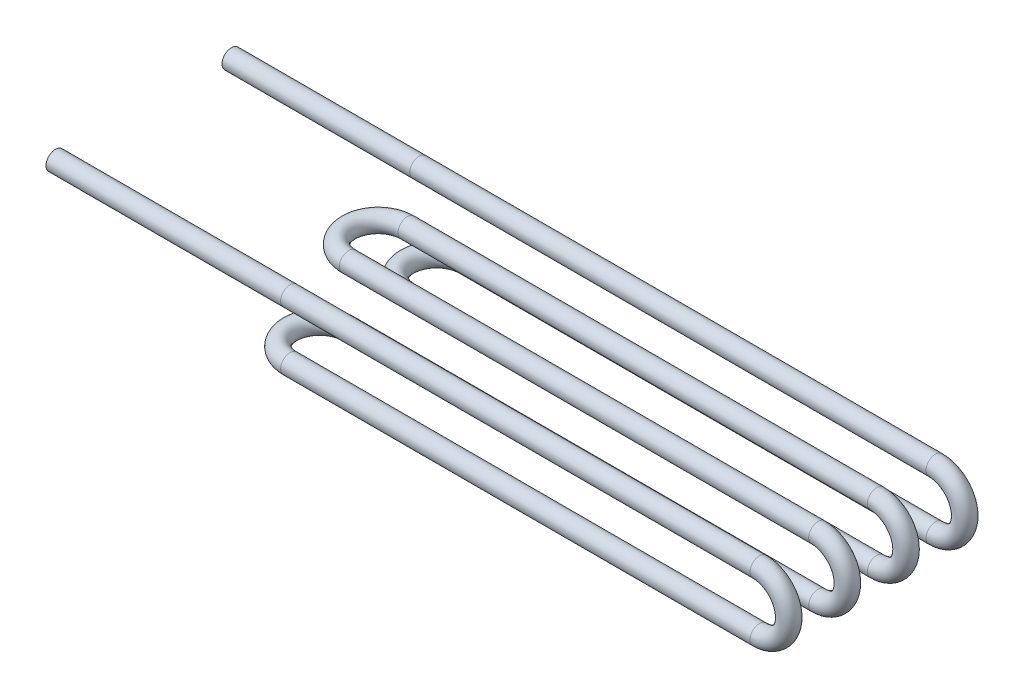
ISO-10303-21;
HEADER;
FILE_DESCRIPTION(('STEP AP214'),'2;1');
FILE_NAME('part.step','',(''),(''),'','','');
FILE_SCHEMA(('AUTOMOTIVE_DESIGN { 1 0 10303 214 1 1 1 1 }'));
ENDSEC;
DATA;
#1=APPLICATION_CONTEXT('core data for automotive mechanical design processes');
#2=APPLICATION_PROTOCOL_DEFINITION('international standard','automotive_design',2000,#1);
#3=PRODUCT_CONTEXT('',#1,'mechanical');
#4=PRODUCT('Part','Part','',(#3));
#5=PRODUCT_RELATED_PRODUCT_CATEGORY('part','',(#4));
#6=PRODUCT_DEFINITION_FORMATION('','',#4);
#7=PRODUCT_DEFINITION_CONTEXT('part definition',#1,'design');
#8=PRODUCT_DEFINITION('design','',#6,#7);
#9=PRODUCT_DEFINITION_SHAPE('','',#8);
#10=(LENGTH_UNIT() NAMED_UNIT(*) SI_UNIT(.MILLI.,.METRE.));
#11=(NAMED_UNIT(*) PLANE_ANGLE_UNIT() SI_UNIT($,.RADIAN.));
#12=(NAMED_UNIT(*) SI_UNIT($,.STERADIAN.) SOLID_ANGLE_UNIT());
#13=UNCERTAINTY_MEASURE_WITH_UNIT(LENGTH_MEASURE(1.E-05),#10,'distance_accuracy_value','');
#14=(GEOMETRIC_REPRESENTATION_CONTEXT(3) GLOBAL_UNCERTAINTY_ASSIGNED_CONTEXT((#13)) GLOBAL_UNIT_ASSIGNED_CONTEXT((#10,
#11,#12)) REPRESENTATION_CONTEXT('',''));
#15=CARTESIAN_POINT('',(0.,0.,0.));
#16=DIRECTION('',(0.,0.,1.));
#17=DIRECTION('',(1.,0.,0.));
#18=AXIS2_PLACEMENT_3D('',#15,#16,#17);
#19=CARTESIAN_POINT('',(-80.,0.,74.9992339235413));
#20=DIRECTION('',(1.,0.,0.));
#21=DIRECTION('',(0.,1.,0.));
#22=AXIS2_PLACEMENT_3D('',#19,#20,#21);
#23=CYLINDRICAL_SURFACE('',#22,4.);
#24=CARTESIAN_POINT('',(19.9999999999998,0.,74.9992339235413));
#25=DIRECTION('',(-1.,0.,0.));
#26=DIRECTION('',(0.,2.63801784115706E-05,0.999999999652043));
#27=AXIS2_PLACEMENT_3D('',#24,#25,#26);
#28=CIRCLE('',#27,4.);
#29=CARTESIAN_POINT('',(19.9999999999998,0.00010552071372467,78.9992339221495));
#30=VERTEX_POINT('',#29);
#31=EDGE_CURVE('E56',#30,#30,#28,.T.);
#32=ORIENTED_EDGE('',*,*,#31,.T.);
#33=EDGE_LOOP('',(#32));
#34=FACE_BOUND('',#33,.T.);
#35=CARTESIAN_POINT('',(-80.,0.,74.9992339235413));
#36=DIRECTION('',(-1.,0.,0.));
#37=DIRECTION('',(0.,2.63801784115706E-05,0.999999999652043));
#38=AXIS2_PLACEMENT_3D('',#35,#36,#37);
#39=CIRCLE('',#38,4.);
#40=CARTESIAN_POINT('',(-80.,0.000105520713672086,78.9992339221495));
#41=VERTEX_POINT('',#40);
#42=EDGE_CURVE('E53',#41,#41,#39,.T.);
#43=ORIENTED_EDGE('',*,*,#42,.F.);
#44=EDGE_LOOP('',(#43));
#45=FACE_BOUND('',#44,.T.);
#46=ADVANCED_FACE('F32',(#34,#45),#23,.T.);
#47=CARTESIAN_POINT('',(19.9999999999998,0.,74.9992339235413));
#48=DIRECTION('',(1.,0.,0.));
#49=DIRECTION('',(0.,0.,-1.));
#50=AXIS2_PLACEMENT_3D('',#47,#48,#49);
#51=CYLINDRICAL_SURFACE('',#50,4.);
#52=CARTESIAN_POINT('',(220.,0.,74.9992339235413));
#53=DIRECTION('',(-1.,0.,0.));
#54=DIRECTION('',(0.,2.63801784115706E-05,0.999999999652043));
#55=AXIS2_PLACEMENT_3D('',#52,#53,#54);
#56=CIRCLE('',#55,4.);
#57=CARTESIAN_POINT('',(220.,4.00000000000009,74.9992339235413));
#58=VERTEX_POINT('',#57);
#59=EDGE_CURVE('E59',#58,#58,#56,.T.);
#60=ORIENTED_EDGE('',*,*,#59,.T.);
#61=EDGE_LOOP('',(#60));
#62=FACE_BOUND('',#61,.T.);
#63=ORIENTED_EDGE('',*,*,#31,.F.);
#64=EDGE_LOOP('',(#63));
#65=FACE_BOUND('',#64,.T.);
#66=ADVANCED_FACE('F137',(#62,#65),#51,.T.);
#67=CARTESIAN_POINT('',(220.,-12.4999999999999,74.9992339235413));
#68=DIRECTION('',(0.,0.,-1.));
#69=DIRECTION('',(-1.,0.,0.));
#70=AXIS2_PLACEMENT_3D('',#67,#68,#69);
#71=TOROIDAL_SURFACE('',#70,12.5,4.);
#72=CARTESIAN_POINT('',(220.,-24.9999999999999,74.9992339235413));
#73=DIRECTION('',(1.,0.,0.));
#74=DIRECTION('',(0.,-2.63801784115706E-05,0.999999999652043));
#75=AXIS2_PLACEMENT_3D('',#72,#73,#74);
#76=CIRCLE('',#75,4.);
#77=CARTESIAN_POINT('',(220.,-28.9999999999999,74.9992339235413));
#78=VERTEX_POINT('',#77);
#79=EDGE_CURVE('E62',#78,#78,#76,.T.);
#80=CARTESIAN_POINT('',(220.,-12.4999999999999,74.9992339235413));
#81=DIRECTION('',(0.,0.,-1.));
#82=DIRECTION('',(-1.,0.,0.));
#83=AXIS2_PLACEMENT_3D('',#80,#81,#82);
#84=CIRCLE('',#83,16.5);
#85=EDGE_CURVE('',#58,#78,#84,.T.);
#86=ORIENTED_EDGE('',*,*,#59,.F.);
#87=ORIENTED_EDGE('',*,*,#79,.T.);
#88=ORIENTED_EDGE('',*,*,#85,.T.);
#89=ORIENTED_EDGE('',*,*,#85,.F.);
#90=EDGE_LOOP('',(#86,#88,#87,#89));
#91=FACE_BOUND('',#90,.T.);
#92=ADVANCED_FACE('F141',(#91),#71,.T.);
#93=CARTESIAN_POINT('',(220.,-24.9999999999999,74.9992339235413));
#94=DIRECTION('',(-1.,0.,0.));
#95=DIRECTION('',(0.,0.,1.));
#96=AXIS2_PLACEMENT_3D('',#93,#94,#95);
#97=CYLINDRICAL_SURFACE('',#96,4.);
#98=CARTESIAN_POINT('',(19.9999999999998,-24.9999999999999,74.9992339235413));
#99=DIRECTION('',(1.,0.,0.));
#100=DIRECTION('',(0.,-2.63801784115706E-05,0.999999999652043));
#101=AXIS2_PLACEMENT_3D('',#98,#99,#100);
#102=CIRCLE('',#101,4.);
#103=CARTESIAN_POINT('',(19.9999999999998,-25.0264824714281,78.999146257419));
#104=VERTEX_POINT('',#103);
#105=EDGE_CURVE('E65',#104,#104,#102,.T.);
#106=ORIENTED_EDGE('',*,*,#105,.T.);
#107=EDGE_LOOP('',(#106));
#108=FACE_BOUND('',#107,.T.);
#109=ORIENTED_EDGE('',*,*,#79,.F.);
#110=EDGE_LOOP('',(#109));
#111=FACE_BOUND('',#110,.T.);
#112=ADVANCED_FACE('F145',(#108,#111),#97,.T.);
#113=CARTESIAN_POINT('',(19.9999999999998,-24.9172422767867,62.4995078801734));
#114=DIRECTION('',(0.,-0.999978083469428,-0.00662061785705991));
#115=DIRECTION('',(0.,0.00662061785705991,-0.999978083469428));
#116=AXIS2_PLACEMENT_3D('',#113,#114,#115);
#117=TOROIDAL_SURFACE('',#116,12.5,4.);
#118=CARTESIAN_POINT('',(19.9999999999998,-24.8344845535734,49.9997818368056));
#119=DIRECTION('',(-1.,0.,0.));
#120=DIRECTION('',(0.,0.0132145676417762,-0.99991268378896));
#121=AXIS2_PLACEMENT_3D('',#118,#119,#120);
#122=CIRCLE('',#121,4.);
#123=CARTESIAN_POINT('',(19.9999999999998,-24.8080020821452,45.9998695029279));
#124=VERTEX_POINT('',#123);
#125=EDGE_CURVE('E68',#124,#124,#122,.T.);
#126=CARTESIAN_POINT('',(19.9999999999998,-24.9172422767867,62.4995078801734));
#127=DIRECTION('',(0.,-0.999978083469428,-0.00662061785705991));
#128=DIRECTION('',(0.,0.00662061785705991,-0.999978083469428));
#129=AXIS2_PLACEMENT_3D('',#126,#127,#128);
#130=CIRCLE('',#129,16.5);
#131=EDGE_CURVE('',#104,#124,#130,.T.);
#132=ORIENTED_EDGE('',*,*,#105,.F.);
#133=ORIENTED_EDGE('',*,*,#125,.T.);
#134=ORIENTED_EDGE('',*,*,#131,.T.);
#135=ORIENTED_EDGE('',*,*,#131,.F.);
#136=EDGE_LOOP('',(#132,#134,#133,#135));
#137=FACE_BOUND('',#136,.T.);
#138=ADVANCED_FACE('F149',(#137),#117,.T.);
#139=CARTESIAN_POINT('',(19.9999999999998,-24.8344845535734,49.9997818368056));
#140=DIRECTION('',(1.,0.,0.));
#141=DIRECTION('',(0.,1.,0.));
#142=AXIS2_PLACEMENT_3D('',#139,#140,#141);
#143=CYLINDRICAL_SURFACE('',#142,4.);
#144=CARTESIAN_POINT('',(220.,-24.8344845535735,49.9997818368056));
#145=DIRECTION('',(-1.,0.,0.));
#146=DIRECTION('',(0.,0.0132145676417762,-0.99991268378896));
#147=AXIS2_PLACEMENT_3D('',#144,#145,#146);
#148=CIRCLE('',#147,4.);
#149=CARTESIAN_POINT('',(220.,-28.8344845532255,49.9998345968145));
#150=VERTEX_POINT('',#149);
#151=EDGE_CURVE('E71',#150,#150,#148,.T.);
#152=ORIENTED_EDGE('',*,*,#151,.T.);
#153=EDGE_LOOP('',(#152));
#154=FACE_BOUND('',#153,.T.);
#155=ORIENTED_EDGE('',*,*,#125,.F.);
#156=EDGE_LOOP('',(#155));
#157=FACE_BOUND('',#156,.T.);
#158=ADVANCED_FACE('F153',(#154,#157),#143,.T.);
#159=CARTESIAN_POINT('',(220.,-12.3344845546608,49.9996169617778));
#160=DIRECTION('',(0.,1.31900022190545E-05,0.999999999913012));
#161=DIRECTION('',(0.,-0.999999999913012,1.31900022190545E-05));
#162=AXIS2_PLACEMENT_3D('',#159,#160,#161);
#163=TOROIDAL_SURFACE('',#162,12.5,4.);
#164=CARTESIAN_POINT('',(220.,0.165515444251831,49.9994520867501));
#165=DIRECTION('',(1.,0.,0.));
#166=DIRECTION('',(0.,-0.013240945338212,-0.999912334840685));
#167=AXIS2_PLACEMENT_3D('',#164,#165,#166);
#168=CIRCLE('',#167,4.);
#169=CARTESIAN_POINT('',(220.,4.16551544390388,49.9993993267412));
#170=VERTEX_POINT('',#169);
#171=EDGE_CURVE('E74',#170,#170,#168,.T.);
#172=CARTESIAN_POINT('',(220.,-12.3344845546608,49.9996169617778));
#173=DIRECTION('',(0.,1.31900022190545E-05,0.999999999913012));
#174=DIRECTION('',(0.,-0.999999999913012,1.31900022190545E-05));
#175=AXIS2_PLACEMENT_3D('',#172,#173,#174);
#176=CIRCLE('',#175,16.5);
#177=EDGE_CURVE('',#150,#170,#176,.T.);
#178=ORIENTED_EDGE('',*,*,#151,.F.);
#179=ORIENTED_EDGE('',*,*,#171,.T.);
#180=ORIENTED_EDGE('',*,*,#177,.T.);
#181=ORIENTED_EDGE('',*,*,#177,.F.);
#182=EDGE_LOOP('',(#178,#180,#179,#181));
#183=FACE_BOUND('',#182,.T.);
#184=ADVANCED_FACE('F157',(#183),#163,.T.);
#185=CARTESIAN_POINT('',(220.,0.16551544425183,49.9994520867501));
#186=DIRECTION('',(-1.,0.,0.));
#187=DIRECTION('',(0.,-1.,0.));
#188=AXIS2_PLACEMENT_3D('',#185,#186,#187);
#189=CYLINDRICAL_SURFACE('',#188,4.);
#190=CARTESIAN_POINT('',(20.,0.165515444251878,49.9994520867501));
#191=DIRECTION('',(1.,0.,0.));
#192=DIRECTION('',(0.,-0.013240945338212,-0.999912334840685));
#193=AXIS2_PLACEMENT_3D('',#190,#191,#192);
#194=CIRCLE('',#193,4.);
#195=CARTESIAN_POINT('',(20.,0.165515444251878,53.9994520867501));
#196=VERTEX_POINT('',#195);
#197=EDGE_CURVE('E77',#196,#196,#194,.T.);
#198=ORIENTED_EDGE('',*,*,#197,.T.);
#199=EDGE_LOOP('',(#198));
#200=FACE_BOUND('',#199,.T.);
#201=ORIENTED_EDGE('',*,*,#171,.F.);
#202=EDGE_LOOP('',(#201));
#203=FACE_BOUND('',#202,.T.);
#204=ADVANCED_FACE('F161',(#200,#203),#189,.T.);
#205=CARTESIAN_POINT('',(20.,0.165515444251878,37.4994520867501));
#206=DIRECTION('',(0.,-1.,0.));
#207=DIRECTION('',(0.,0.,-1.));
#208=AXIS2_PLACEMENT_3D('',#205,#206,#207);
#209=TOROIDAL_SURFACE('',#208,12.5,4.);
#210=CARTESIAN_POINT('',(20.,0.165515444251878,24.9994520867501));
#211=DIRECTION('',(-1.,0.,0.));
#212=DIRECTION('',(0.,-0.013240945338212,0.999912334840685));
#213=AXIS2_PLACEMENT_3D('',#210,#211,#212);
#214=CIRCLE('',#213,4.);
#215=CARTESIAN_POINT('',(20.,0.165515444251878,20.9994520867501));
#216=VERTEX_POINT('',#215);
#217=EDGE_CURVE('E80',#216,#216,#214,.T.);
#218=CARTESIAN_POINT('',(20.,0.165515444251878,37.4994520867501));
#219=DIRECTION('',(0.,-1.,0.));
#220=DIRECTION('',(0.,0.,-1.));
#221=AXIS2_PLACEMENT_3D('',#218,#219,#220);
#222=CIRCLE('',#221,16.5);
#223=EDGE_CURVE('',#196,#216,#222,.T.);
#224=ORIENTED_EDGE('',*,*,#197,.F.);
#225=ORIENTED_EDGE('',*,*,#217,.T.);
#226=ORIENTED_EDGE('',*,*,#223,.T.);
#227=ORIENTED_EDGE('',*,*,#223,.F.);
#228=EDGE_LOOP('',(#224,#226,#225,#227));
#229=FACE_BOUND('',#228,.T.);
#230=ADVANCED_FACE('F165',(#229),#209,.T.);
#231=CARTESIAN_POINT('',(20.,0.16551544425186,24.9994520867501));
#232=DIRECTION('',(1.,0.,0.));
#233=DIRECTION('',(0.,1.,0.));
#234=AXIS2_PLACEMENT_3D('',#231,#232,#233);
#235=CYLINDRICAL_SURFACE('',#234,4.);
#236=CARTESIAN_POINT('',(220.,0.165515444251848,24.9994520867501));
#237=DIRECTION('',(-1.,0.,0.));
#238=DIRECTION('',(0.,-0.013240945338212,0.999912334840685));
#239=AXIS2_PLACEMENT_3D('',#236,#237,#238);
#240=CIRCLE('',#239,4.);
#241=CARTESIAN_POINT('',(220.,4.16551544425185,24.9994520867501));
#242=VERTEX_POINT('',#241);
#243=EDGE_CURVE('E83',#242,#242,#240,.T.);
#244=ORIENTED_EDGE('',*,*,#243,.T.);
#245=EDGE_LOOP('',(#244));
#246=FACE_BOUND('',#245,.T.);
#247=ORIENTED_EDGE('',*,*,#217,.F.);
#248=EDGE_LOOP('',(#247));
#249=FACE_BOUND('',#248,.T.);
#250=ADVANCED_FACE('F169',(#246,#249),#235,.T.);
#251=CARTESIAN_POINT('',(220.,-12.3344845557481,24.9994520867501));
#252=DIRECTION('',(0.,0.,-1.));
#253=DIRECTION('',(-1.,0.,0.));
#254=AXIS2_PLACEMENT_3D('',#251,#252,#253);
#255=TOROIDAL_SURFACE('',#254,12.5,4.);
#256=CARTESIAN_POINT('',(220.,-24.8344845557481,24.9994520867501));
#257=DIRECTION('',(1.,0.,0.));
#258=DIRECTION('',(0.,0.013240945338212,0.999912334840685));
#259=AXIS2_PLACEMENT_3D('',#256,#257,#258);
#260=CIRCLE('',#259,4.);
#261=CARTESIAN_POINT('',(220.,-28.8344845557481,24.9994520867501));
#262=VERTEX_POINT('',#261);
#263=EDGE_CURVE('E86',#262,#262,#260,.T.);
#264=CARTESIAN_POINT('',(220.,-12.3344845557481,24.9994520867501));
#265=DIRECTION('',(0.,0.,-1.));
#266=DIRECTION('',(-1.,0.,0.));
#267=AXIS2_PLACEMENT_3D('',#264,#265,#266);
#268=CIRCLE('',#267,16.5);
#269=EDGE_CURVE('',#242,#262,#268,.T.);
#270=ORIENTED_EDGE('',*,*,#243,.F.);
#271=ORIENTED_EDGE('',*,*,#263,.T.);
#272=ORIENTED_EDGE('',*,*,#269,.T.);
#273=ORIENTED_EDGE('',*,*,#269,.F.);
#274=EDGE_LOOP('',(#270,#272,#271,#273));
#275=FACE_BOUND('',#274,.T.);
#276=ADVANCED_FACE('F173',(#275),#255,.T.);
#277=CARTESIAN_POINT('',(220.,-24.8344845557481,24.9994520867501));
#278=DIRECTION('',(-1.,0.,0.));
#279=DIRECTION('',(0.,0.,1.));
#280=AXIS2_PLACEMENT_3D('',#277,#278,#279);
#281=CYLINDRICAL_SURFACE('',#280,4.);
#282=CARTESIAN_POINT('',(20.,-24.8344845557481,24.9994520867501));
#283=DIRECTION('',(1.,0.,0.));
#284=DIRECTION('',(0.,0.013240945338212,0.999912334840685));
#285=AXIS2_PLACEMENT_3D('',#282,#283,#284);
#286=CIRCLE('',#285,4.);
#287=CARTESIAN_POINT('',(20.,-24.8080020846678,28.9993644206301));
#288=VERTEX_POINT('',#287);
#289=EDGE_CURVE('E89',#288,#288,#286,.T.);
#290=ORIENTED_EDGE('',*,*,#289,.T.);
#291=EDGE_LOOP('',(#290));
#292=FACE_BOUND('',#291,.T.);
#293=ORIENTED_EDGE('',*,*,#263,.F.);
#294=EDGE_LOOP('',(#293));
#295=FACE_BOUND('',#294,.T.);
#296=ADVANCED_FACE('F177',(#292,#295),#281,.T.);
#297=CARTESIAN_POINT('',(20.,-24.9172422778741,12.499726043375));
#298=DIRECTION('',(0.,-0.999978083470004,0.00662061777007394));
#299=DIRECTION('',(0.,-0.00662061777007394,-0.999978083470004));
#300=AXIS2_PLACEMENT_3D('',#297,#298,#299);
#301=TOROIDAL_SURFACE('',#300,12.5,4.);
#302=CARTESIAN_POINT('',(20.,-25.,0.));
#303=DIRECTION('',(-1.,0.,0.));
#304=DIRECTION('',(0.,0.,-1.));
#305=AXIS2_PLACEMENT_3D('',#302,#303,#304);
#306=CIRCLE('',#305,4.);
#307=CARTESIAN_POINT('',(20.,-25.0264824710803,-3.99991233388003));
#308=VERTEX_POINT('',#307);
#309=EDGE_CURVE('E92',#308,#308,#306,.T.);
#310=CARTESIAN_POINT('',(20.,-24.9172422778741,12.499726043375));
#311=DIRECTION('',(0.,-0.999978083470004,0.00662061777007394));
#312=DIRECTION('',(0.,-0.00662061777007394,-0.999978083470004));
#313=AXIS2_PLACEMENT_3D('',#310,#311,#312);
#314=CIRCLE('',#313,16.5);
#315=EDGE_CURVE('',#288,#308,#314,.T.);
#316=ORIENTED_EDGE('',*,*,#289,.F.);
#317=ORIENTED_EDGE('',*,*,#309,.T.);
#318=ORIENTED_EDGE('',*,*,#315,.T.);
#319=ORIENTED_EDGE('',*,*,#315,.F.);
#320=EDGE_LOOP('',(#316,#318,#317,#319));
#321=FACE_BOUND('',#320,.T.);
#322=ADVANCED_FACE('F181',(#321),#301,.T.);
#323=CARTESIAN_POINT('',(20.,-25.,0.));
#324=DIRECTION('',(1.,0.,0.));
#325=DIRECTION('',(0.,0.,-1.));
#326=AXIS2_PLACEMENT_3D('',#323,#324,#325);
#327=CYLINDRICAL_SURFACE('',#326,4.);
#328=CARTESIAN_POINT('',(220.,-25.,0.));
#329=DIRECTION('',(-1.,0.,0.));
#330=DIRECTION('',(0.,0.,-1.));
#331=AXIS2_PLACEMENT_3D('',#328,#329,#330);
#332=CIRCLE('',#331,4.);
#333=CARTESIAN_POINT('',(220.,-29.,0.));
#334=VERTEX_POINT('',#333);
#335=EDGE_CURVE('E95',#334,#334,#332,.T.);
#336=ORIENTED_EDGE('',*,*,#335,.T.);
#337=EDGE_LOOP('',(#336));
#338=FACE_BOUND('',#337,.T.);
#339=ORIENTED_EDGE('',*,*,#309,.F.);
#340=EDGE_LOOP('',(#339));
#341=FACE_BOUND('',#340,.T.);
#342=ADVANCED_FACE('F185',(#338,#341),#327,.T.);
#343=CARTESIAN_POINT('',(220.,-12.5,0.));
#344=DIRECTION('',(0.,0.,1.));
#345=DIRECTION('',(1.,0.,0.));
#346=AXIS2_PLACEMENT_3D('',#343,#344,#345);
#347=TOROIDAL_SURFACE('',#346,12.5,4.);
#348=CARTESIAN_POINT('',(220.,0.,0.));
#349=DIRECTION('',(1.,0.,0.));
#350=DIRECTION('',(0.,0.,-1.));
#351=AXIS2_PLACEMENT_3D('',#348,#349,#350);
#352=CIRCLE('',#351,4.);
#353=CARTESIAN_POINT('',(220.,4.,0.));
#354=VERTEX_POINT('',#353);
#355=EDGE_CURVE('E97',#354,#354,#352,.T.);
#356=CARTESIAN_POINT('',(220.,-12.5,0.));
#357=DIRECTION('',(0.,0.,1.));
#358=DIRECTION('',(1.,0.,0.));
#359=AXIS2_PLACEMENT_3D('',#356,#357,#358);
#360=CIRCLE('',#359,16.5);
#361=EDGE_CURVE('',#334,#354,#360,.T.);
#362=ORIENTED_EDGE('',*,*,#335,.F.);
#363=ORIENTED_EDGE('',*,*,#355,.T.);
#364=ORIENTED_EDGE('',*,*,#361,.T.);
#365=ORIENTED_EDGE('',*,*,#361,.F.);
#366=EDGE_LOOP('',(#362,#364,#363,#365));
#367=FACE_BOUND('',#366,.T.);
#368=ADVANCED_FACE('F117',(#367),#347,.T.);
#369=CARTESIAN_POINT('',(220.,0.,0.));
#370=DIRECTION('',(-1.,0.,0.));
#371=DIRECTION('',(0.,0.,1.));
#372=AXIS2_PLACEMENT_3D('',#369,#370,#371);
#373=CYLINDRICAL_SURFACE('',#372,4.);
#374=CARTESIAN_POINT('',(0.,0.,0.));
#375=DIRECTION('',(1.,0.,0.));
#376=DIRECTION('',(0.,0.,-1.));
#377=AXIS2_PLACEMENT_3D('',#374,#375,#376);
#378=CIRCLE('',#377,4.);
#379=CARTESIAN_POINT('',(0.,0.,-4.));
#380=VERTEX_POINT('',#379);
#381=EDGE_CURVE('E36',#380,#380,#378,.T.);
#382=ORIENTED_EDGE('',*,*,#381,.T.);
#383=EDGE_LOOP('',(#382));
#384=FACE_BOUND('',#383,.T.);
#385=ORIENTED_EDGE('',*,*,#355,.F.);
#386=EDGE_LOOP('',(#385));
#387=FACE_BOUND('',#386,.T.);
#388=ADVANCED_FACE('F104',(#384,#387),#373,.T.);
#389=CARTESIAN_POINT('',(0.,0.,0.));
#390=DIRECTION('',(-1.,0.,0.));
#391=DIRECTION('',(0.,0.,1.));
#392=AXIS2_PLACEMENT_3D('',#389,#390,#391);
#393=CYLINDRICAL_SURFACE('',#392,4.);
#394=CARTESIAN_POINT('',(-80.,0.,0.));
#395=DIRECTION('',(1.,0.,0.));
#396=DIRECTION('',(0.,0.,-1.));
#397=AXIS2_PLACEMENT_3D('',#394,#395,#396);
#398=CIRCLE('',#397,4.);
#399=CARTESIAN_POINT('',(-80.,0.,-4.));
#400=VERTEX_POINT('',#399);
#401=EDGE_CURVE('E49',#400,#400,#398,.T.);
#402=ORIENTED_EDGE('',*,*,#401,.T.);
#403=EDGE_LOOP('',(#402));
#404=FACE_BOUND('',#403,.T.);
#405=ORIENTED_EDGE('',*,*,#381,.F.);
#406=EDGE_LOOP('',(#405));
#407=FACE_BOUND('',#406,.T.);
#408=ADVANCED_FACE('F34',(#404,#407),#393,.T.);
#409=CARTESIAN_POINT('',(-80.,0.,74.9992339235413));
#410=DIRECTION('',(-1.,0.,0.));
#411=DIRECTION('',(0.,2.63801784115706E-05,0.999999999652043));
#412=AXIS2_PLACEMENT_3D('',#409,#410,#411);
#413=PLANE('',#412);
#414=CARTESIAN_POINT('',(-80.,0.,74.9992339235413));
#415=DIRECTION('',(-1.,0.,0.));
#416=DIRECTION('',(0.,2.63801784115706E-05,0.999999999652043));
#417=AXIS2_PLACEMENT_3D('',#414,#415,#416);
#418=CIRCLE('',#417,3.);
#419=CARTESIAN_POINT('',(-80.,7.91405352605157E-05,77.9992339224975));
#420=VERTEX_POINT('',#419);
#421=EDGE_CURVE('E52',#420,#420,#418,.F.);
#422=ORIENTED_EDGE('',*,*,#421,.T.);
#423=EDGE_LOOP('',(#422));
#424=FACE_BOUND('',#423,.T.);
#425=ORIENTED_EDGE('',*,*,#42,.T.);
#426=EDGE_LOOP('',(#425));
#427=FACE_BOUND('',#426,.T.);
#428=ADVANCED_FACE('F108',(#424,#427),#413,.T.);
#429=CARTESIAN_POINT('',(-80.,0.,0.));
#430=DIRECTION('',(1.,0.,0.));
#431=DIRECTION('',(0.,0.,-1.));
#432=AXIS2_PLACEMENT_3D('',#429,#430,#431);
#433=PLANE('',#432);
#434=CARTESIAN_POINT('',(-80.,0.,0.));
#435=DIRECTION('',(1.,0.,0.));
#436=DIRECTION('',(0.,0.,-1.));
#437=AXIS2_PLACEMENT_3D('',#434,#435,#436);
#438=CIRCLE('',#437,3.);
#439=CARTESIAN_POINT('',(-80.,0.,-3.));
#440=VERTEX_POINT('',#439);
#441=EDGE_CURVE('E10',#440,#440,#438,.F.);
#442=ORIENTED_EDGE('',*,*,#441,.F.);
#443=EDGE_LOOP('',(#442));
#444=FACE_BOUND('',#443,.T.);
#445=ORIENTED_EDGE('',*,*,#401,.F.);
#446=EDGE_LOOP('',(#445));
#447=FACE_BOUND('',#446,.T.);
#448=ADVANCED_FACE('F114',(#444,#447),#433,.F.);
#449=CARTESIAN_POINT('',(-80.,0.,74.9992339235413));
#450=DIRECTION('',(1.,0.,0.));
#451=DIRECTION('',(0.,1.,0.));
#452=AXIS2_PLACEMENT_3D('',#449,#450,#451);
#453=CYLINDRICAL_SURFACE('',#452,3.);
#454=CARTESIAN_POINT('',(19.9999999999998,0.,74.9992339235413));
#455=DIRECTION('',(-1.,0.,0.));
#456=DIRECTION('',(0.,2.63801784115706E-05,0.999999999652043));
#457=AXIS2_PLACEMENT_3D('',#454,#455,#456);
#458=CIRCLE('',#457,3.);
#459=CARTESIAN_POINT('',(19.9999999999998,7.91405353130995E-05,77.9992339224974));
#460=VERTEX_POINT('',#459);
#461=EDGE_CURVE('E451',#460,#460,#458,.F.);
#462=ORIENTED_EDGE('',*,*,#461,.T.);
#463=EDGE_LOOP('',(#462));
#464=FACE_BOUND('',#463,.T.);
#465=ORIENTED_EDGE('',*,*,#421,.F.);
#466=EDGE_LOOP('',(#465));
#467=FACE_BOUND('',#466,.T.);
#468=ADVANCED_FACE('F132',(#464,#467),#453,.F.);
#469=CARTESIAN_POINT('',(19.9999999999998,0.,74.9992339235413));
#470=DIRECTION('',(1.,0.,0.));
#471=DIRECTION('',(0.,0.,-1.));
#472=AXIS2_PLACEMENT_3D('',#469,#470,#471);
#473=CYLINDRICAL_SURFACE('',#472,3.);
#474=CARTESIAN_POINT('',(220.,0.,74.9992339235413));
#475=DIRECTION('',(-1.,0.,0.));
#476=DIRECTION('',(0.,2.63801784115706E-05,0.999999999652043));
#477=AXIS2_PLACEMENT_3D('',#474,#475,#476);
#478=CIRCLE('',#477,3.);
#479=CARTESIAN_POINT('',(220.,3.00000000000009,74.9992339235413));
#480=VERTEX_POINT('',#479);
#481=EDGE_CURVE('E448',#480,#480,#478,.F.);
#482=ORIENTED_EDGE('',*,*,#481,.T.);
#483=EDGE_LOOP('',(#482));
#484=FACE_BOUND('',#483,.T.);
#485=ORIENTED_EDGE('',*,*,#461,.F.);
#486=EDGE_LOOP('',(#485));
#487=FACE_BOUND('',#486,.T.);
#488=ADVANCED_FACE('F255',(#484,#487),#473,.F.);
#489=CARTESIAN_POINT('',(220.,-12.4999999999999,74.9992339235413));
#490=DIRECTION('',(0.,0.,-1.));
#491=DIRECTION('',(-1.,0.,0.));
#492=AXIS2_PLACEMENT_3D('',#489,#490,#491);
#493=TOROIDAL_SURFACE('',#492,12.5,3.);
#494=CARTESIAN_POINT('',(220.,-24.9999999999999,74.9992339235413));
#495=DIRECTION('',(1.,0.,0.));
#496=DIRECTION('',(0.,-2.63801784115706E-05,0.999999999652043));
#497=AXIS2_PLACEMENT_3D('',#494,#495,#496);
#498=CIRCLE('',#497,3.);
#499=CARTESIAN_POINT('',(220.,-27.9999999999999,74.9992339235413));
#500=VERTEX_POINT('',#499);
#501=EDGE_CURVE('E445',#500,#500,#498,.F.);
#502=CARTESIAN_POINT('',(220.,-12.4999999999999,74.9992339235413));
#503=DIRECTION('',(0.,0.,-1.));
#504=DIRECTION('',(-1.,0.,0.));
#505=AXIS2_PLACEMENT_3D('',#502,#503,#504);
#506=CIRCLE('',#505,15.5);
#507=EDGE_CURVE('',#480,#500,#506,.T.);
#508=ORIENTED_EDGE('',*,*,#481,.F.);
#509=ORIENTED_EDGE('',*,*,#501,.T.);
#510=ORIENTED_EDGE('',*,*,#507,.T.);
#511=ORIENTED_EDGE('',*,*,#507,.F.);
#512=EDGE_LOOP('',(#508,#510,#509,#511));
#513=FACE_BOUND('',#512,.T.);
#514=ADVANCED_FACE('F265',(#513),#493,.F.);
#515=CARTESIAN_POINT('',(220.,-24.9999999999999,74.9992339235413));
#516=DIRECTION('',(-1.,0.,0.));
#517=DIRECTION('',(0.,0.,1.));
#518=AXIS2_PLACEMENT_3D('',#515,#516,#517);
#519=CYLINDRICAL_SURFACE('',#518,3.);
#520=CARTESIAN_POINT('',(19.9999999999998,-24.9999999999999,74.9992339235413));
#521=DIRECTION('',(1.,0.,0.));
#522=DIRECTION('',(0.,-2.63801784115706E-05,0.999999999652043));
#523=AXIS2_PLACEMENT_3D('',#520,#521,#522);
#524=CIRCLE('',#523,3.);
#525=CARTESIAN_POINT('',(19.9999999999998,-25.0198618535711,77.9991681739496));
#526=VERTEX_POINT('',#525);
#527=EDGE_CURVE('E442',#526,#526,#524,.F.);
#528=ORIENTED_EDGE('',*,*,#527,.T.);
#529=EDGE_LOOP('',(#528));
#530=FACE_BOUND('',#529,.T.);
#531=ORIENTED_EDGE('',*,*,#501,.F.);
#532=EDGE_LOOP('',(#531));
#533=FACE_BOUND('',#532,.T.);
#534=ADVANCED_FACE('F275',(#530,#533),#519,.F.);
#535=CARTESIAN_POINT('',(19.9999999999998,-24.9172422767867,62.4995078801734));
#536=DIRECTION('',(0.,-0.999978083469428,-0.00662061785705991));
#537=DIRECTION('',(0.,0.00662061785705991,-0.999978083469428));
#538=AXIS2_PLACEMENT_3D('',#535,#536,#537);
#539=TOROIDAL_SURFACE('',#538,12.5,3.);
#540=CARTESIAN_POINT('',(19.9999999999998,-24.8344845535734,49.9997818368056));
#541=DIRECTION('',(-1.,0.,0.));
#542=DIRECTION('',(0.,0.0132145676417762,-0.99991268378896));
#543=AXIS2_PLACEMENT_3D('',#540,#541,#542);
#544=CIRCLE('',#543,3.);
#545=CARTESIAN_POINT('',(19.9999999999998,-24.8146227000022,46.9998475863973));
#546=VERTEX_POINT('',#545);
#547=EDGE_CURVE('E439',#546,#546,#544,.F.);
#548=CARTESIAN_POINT('',(19.9999999999998,-24.9172422767867,62.4995078801734));
#549=DIRECTION('',(0.,-0.999978083469428,-0.00662061785705991));
#550=DIRECTION('',(0.,0.00662061785705991,-0.999978083469428));
#551=AXIS2_PLACEMENT_3D('',#548,#549,#550);
#552=CIRCLE('',#551,15.5);
#553=EDGE_CURVE('',#526,#546,#552,.T.);
#554=ORIENTED_EDGE('',*,*,#527,.F.);
#555=ORIENTED_EDGE('',*,*,#547,.T.);
#556=ORIENTED_EDGE('',*,*,#553,.T.);
#557=ORIENTED_EDGE('',*,*,#553,.F.);
#558=EDGE_LOOP('',(#554,#556,#555,#557));
#559=FACE_BOUND('',#558,.T.);
#560=ADVANCED_FACE('F285',(#559),#539,.F.);
#561=CARTESIAN_POINT('',(19.9999999999998,-24.8344845535734,49.9997818368056));
#562=DIRECTION('',(1.,0.,0.));
#563=DIRECTION('',(0.,1.,0.));
#564=AXIS2_PLACEMENT_3D('',#561,#562,#563);
#565=CYLINDRICAL_SURFACE('',#564,3.);
#566=CARTESIAN_POINT('',(220.,-24.8344845535735,49.9997818368056));
#567=DIRECTION('',(-1.,0.,0.));
#568=DIRECTION('',(0.,0.0132145676417762,-0.99991268378896));
#569=AXIS2_PLACEMENT_3D('',#566,#567,#568);
#570=CIRCLE('',#569,3.);
#571=CARTESIAN_POINT('',(220.,-27.8344845533125,49.9998214068122));
#572=VERTEX_POINT('',#571);
#573=EDGE_CURVE('E436',#572,#572,#570,.F.);
#574=ORIENTED_EDGE('',*,*,#573,.T.);
#575=EDGE_LOOP('',(#574));
#576=FACE_BOUND('',#575,.T.);
#577=ORIENTED_EDGE('',*,*,#547,.F.);
#578=EDGE_LOOP('',(#577));
#579=FACE_BOUND('',#578,.T.);
#580=ADVANCED_FACE('F295',(#576,#579),#565,.F.);
#581=CARTESIAN_POINT('',(220.,-12.3344845546608,49.9996169617778));
#582=DIRECTION('',(0.,1.31900022190545E-05,0.999999999913012));
#583=DIRECTION('',(0.,-0.999999999913012,1.31900022190545E-05));
#584=AXIS2_PLACEMENT_3D('',#581,#582,#583);
#585=TOROIDAL_SURFACE('',#584,12.5,3.);
#586=CARTESIAN_POINT('',(220.,0.165515444251831,49.9994520867501));
#587=DIRECTION('',(1.,0.,0.));
#588=DIRECTION('',(0.,-0.013240945338212,-0.999912334840685));
#589=AXIS2_PLACEMENT_3D('',#586,#587,#588);
#590=CIRCLE('',#589,3.);
#591=CARTESIAN_POINT('',(220.,3.16551544399087,49.9994125167434));
#592=VERTEX_POINT('',#591);
#593=EDGE_CURVE('E433',#592,#592,#590,.F.);
#594=CARTESIAN_POINT('',(220.,-12.3344845546608,49.9996169617778));
#595=DIRECTION('',(0.,1.31900022190545E-05,0.999999999913012));
#596=DIRECTION('',(0.,-0.999999999913012,1.31900022190545E-05));
#597=AXIS2_PLACEMENT_3D('',#594,#595,#596);
#598=CIRCLE('',#597,15.5);
#599=EDGE_CURVE('',#572,#592,#598,.T.);
#600=ORIENTED_EDGE('',*,*,#573,.F.);
#601=ORIENTED_EDGE('',*,*,#593,.T.);
#602=ORIENTED_EDGE('',*,*,#599,.T.);
#603=ORIENTED_EDGE('',*,*,#599,.F.);
#604=EDGE_LOOP('',(#600,#602,#601,#603));
#605=FACE_BOUND('',#604,.T.);
#606=ADVANCED_FACE('F305',(#605),#585,.F.);
#607=CARTESIAN_POINT('',(220.,0.16551544425183,49.9994520867501));
#608=DIRECTION('',(-1.,0.,0.));
#609=DIRECTION('',(0.,-1.,0.));
#610=AXIS2_PLACEMENT_3D('',#607,#608,#609);
#611=CYLINDRICAL_SURFACE('',#610,3.);
#612=CARTESIAN_POINT('',(20.,0.165515444251878,49.9994520867501));
#613=DIRECTION('',(1.,0.,0.));
#614=DIRECTION('',(0.,-0.013240945338212,-0.999912334840685));
#615=AXIS2_PLACEMENT_3D('',#612,#613,#614);
#616=CIRCLE('',#615,3.);
#617=CARTESIAN_POINT('',(20.,0.165515444251878,52.9994520867501));
#618=VERTEX_POINT('',#617);
#619=EDGE_CURVE('E430',#618,#618,#616,.F.);
#620=ORIENTED_EDGE('',*,*,#619,.T.);
#621=EDGE_LOOP('',(#620));
#622=FACE_BOUND('',#621,.T.);
#623=ORIENTED_EDGE('',*,*,#593,.F.);
#624=EDGE_LOOP('',(#623));
#625=FACE_BOUND('',#624,.T.);
#626=ADVANCED_FACE('F315',(#622,#625),#611,.F.);
#627=CARTESIAN_POINT('',(20.,0.165515444251878,37.4994520867501));
#628=DIRECTION('',(0.,-1.,0.));
#629=DIRECTION('',(0.,0.,-1.));
#630=AXIS2_PLACEMENT_3D('',#627,#628,#629);
#631=TOROIDAL_SURFACE('',#630,12.5,3.);
#632=CARTESIAN_POINT('',(20.,0.165515444251878,24.9994520867501));
#633=DIRECTION('',(-1.,0.,0.));
#634=DIRECTION('',(0.,-0.013240945338212,0.999912334840685));
#635=AXIS2_PLACEMENT_3D('',#632,#633,#634);
#636=CIRCLE('',#635,3.);
#637=CARTESIAN_POINT('',(20.,0.165515444251878,21.9994520867501));
#638=VERTEX_POINT('',#637);
#639=EDGE_CURVE('E427',#638,#638,#636,.F.);
#640=CARTESIAN_POINT('',(20.,0.165515444251878,37.4994520867501));
#641=DIRECTION('',(0.,-1.,0.));
#642=DIRECTION('',(0.,0.,-1.));
#643=AXIS2_PLACEMENT_3D('',#640,#641,#642);
#644=CIRCLE('',#643,15.5);
#645=EDGE_CURVE('',#618,#638,#644,.T.);
#646=ORIENTED_EDGE('',*,*,#619,.F.);
#647=ORIENTED_EDGE('',*,*,#639,.T.);
#648=ORIENTED_EDGE('',*,*,#645,.T.);
#649=ORIENTED_EDGE('',*,*,#645,.F.);
#650=EDGE_LOOP('',(#646,#648,#647,#649));
#651=FACE_BOUND('',#650,.T.);
#652=ADVANCED_FACE('F325',(#651),#631,.F.);
#653=CARTESIAN_POINT('',(20.,0.16551544425186,24.9994520867501));
#654=DIRECTION('',(1.,0.,0.));
#655=DIRECTION('',(0.,1.,0.));
#656=AXIS2_PLACEMENT_3D('',#653,#654,#655);
#657=CYLINDRICAL_SURFACE('',#656,3.);
#658=CARTESIAN_POINT('',(220.,0.165515444251848,24.9994520867501));
#659=DIRECTION('',(-1.,0.,0.));
#660=DIRECTION('',(0.,-0.013240945338212,0.999912334840685));
#661=AXIS2_PLACEMENT_3D('',#658,#659,#660);
#662=CIRCLE('',#661,3.);
#663=CARTESIAN_POINT('',(220.,3.16551544425185,24.9994520867501));
#664=VERTEX_POINT('',#663);
#665=EDGE_CURVE('E424',#664,#664,#662,.F.);
#666=ORIENTED_EDGE('',*,*,#665,.T.);
#667=EDGE_LOOP('',(#666));
#668=FACE_BOUND('',#667,.T.);
#669=ORIENTED_EDGE('',*,*,#639,.F.);
#670=EDGE_LOOP('',(#669));
#671=FACE_BOUND('',#670,.T.);
#672=ADVANCED_FACE('F335',(#668,#671),#657,.F.);
#673=CARTESIAN_POINT('',(220.,-12.3344845557481,24.9994520867501));
#674=DIRECTION('',(0.,0.,-1.));
#675=DIRECTION('',(-1.,0.,0.));
#676=AXIS2_PLACEMENT_3D('',#673,#674,#675);
#677=TOROIDAL_SURFACE('',#676,12.5,3.);
#678=CARTESIAN_POINT('',(220.,-24.8344845557481,24.9994520867501));
#679=DIRECTION('',(1.,0.,0.));
#680=DIRECTION('',(0.,0.013240945338212,0.999912334840685));
#681=AXIS2_PLACEMENT_3D('',#678,#679,#680);
#682=CIRCLE('',#681,3.);
#683=CARTESIAN_POINT('',(220.,-27.8344845557481,24.9994520867501));
#684=VERTEX_POINT('',#683);
#685=EDGE_CURVE('E421',#684,#684,#682,.F.);
#686=CARTESIAN_POINT('',(220.,-12.3344845557481,24.9994520867501));
#687=DIRECTION('',(0.,0.,-1.));
#688=DIRECTION('',(-1.,0.,0.));
#689=AXIS2_PLACEMENT_3D('',#686,#687,#688);
#690=CIRCLE('',#689,15.5);
#691=EDGE_CURVE('',#664,#684,#690,.T.);
#692=ORIENTED_EDGE('',*,*,#665,.F.);
#693=ORIENTED_EDGE('',*,*,#685,.T.);
#694=ORIENTED_EDGE('',*,*,#691,.T.);
#695=ORIENTED_EDGE('',*,*,#691,.F.);
#696=EDGE_LOOP('',(#692,#694,#693,#695));
#697=FACE_BOUND('',#696,.T.);
#698=ADVANCED_FACE('F345',(#697),#677,.F.);
#699=CARTESIAN_POINT('',(220.,-24.8344845557481,24.9994520867501));
#700=DIRECTION('',(-1.,0.,0.));
#701=DIRECTION('',(0.,0.,1.));
#702=AXIS2_PLACEMENT_3D('',#699,#700,#701);
#703=CYLINDRICAL_SURFACE('',#702,3.);
#704=CARTESIAN_POINT('',(20.,-24.8344845557481,24.9994520867501));
#705=DIRECTION('',(1.,0.,0.));
#706=DIRECTION('',(0.,0.013240945338212,0.999912334840685));
#707=AXIS2_PLACEMENT_3D('',#704,#705,#706);
#708=CIRCLE('',#707,3.);
#709=CARTESIAN_POINT('',(20.,-24.8146227024379,27.9993863371601));
#710=VERTEX_POINT('',#709);
#711=EDGE_CURVE('E416',#710,#710,#708,.F.);
#712=ORIENTED_EDGE('',*,*,#711,.T.);
#713=EDGE_LOOP('',(#712));
#714=FACE_BOUND('',#713,.T.);
#715=ORIENTED_EDGE('',*,*,#685,.F.);
#716=EDGE_LOOP('',(#715));
#717=FACE_BOUND('',#716,.T.);
#718=ADVANCED_FACE('F355',(#714,#717),#703,.F.);
#719=CARTESIAN_POINT('',(20.,-24.9172422778741,12.499726043375));
#720=DIRECTION('',(0.,-0.999978083470004,0.00662061777007394));
#721=DIRECTION('',(0.,-0.00662061777007394,-0.999978083470004));
#722=AXIS2_PLACEMENT_3D('',#719,#720,#721);
#723=TOROIDAL_SURFACE('',#722,12.5,3.);
#724=CARTESIAN_POINT('',(20.,-25.,0.));
#725=DIRECTION('',(-1.,0.,0.));
#726=DIRECTION('',(0.,0.,-1.));
#727=AXIS2_PLACEMENT_3D('',#724,#725,#726);
#728=CIRCLE('',#727,3.);
#729=CARTESIAN_POINT('',(20.,-25.0198618533102,-2.99993425041003));
#730=VERTEX_POINT('',#729);
#731=EDGE_CURVE('E413',#730,#730,#728,.F.);
#732=CARTESIAN_POINT('',(20.,-24.9172422778741,12.499726043375));
#733=DIRECTION('',(0.,-0.999978083470004,0.00662061777007394));
#734=DIRECTION('',(0.,-0.00662061777007394,-0.999978083470004));
#735=AXIS2_PLACEMENT_3D('',#732,#733,#734);
#736=CIRCLE('',#735,15.5);
#737=EDGE_CURVE('',#710,#730,#736,.T.);
#738=ORIENTED_EDGE('',*,*,#711,.F.);
#739=ORIENTED_EDGE('',*,*,#731,.T.);
#740=ORIENTED_EDGE('',*,*,#737,.T.);
#741=ORIENTED_EDGE('',*,*,#737,.F.);
#742=EDGE_LOOP('',(#738,#740,#739,#741));
#743=FACE_BOUND('',#742,.T.);
#744=ADVANCED_FACE('F365',(#743),#723,.F.);
#745=CARTESIAN_POINT('',(20.,-25.,0.));
#746=DIRECTION('',(1.,0.,0.));
#747=DIRECTION('',(0.,0.,-1.));
#748=AXIS2_PLACEMENT_3D('',#745,#746,#747);
#749=CYLINDRICAL_SURFACE('',#748,3.);
#750=CARTESIAN_POINT('',(220.,-25.,0.));
#751=DIRECTION('',(-1.,0.,0.));
#752=DIRECTION('',(0.,0.,-1.));
#753=AXIS2_PLACEMENT_3D('',#750,#751,#752);
#754=CIRCLE('',#753,3.);
#755=CARTESIAN_POINT('',(220.,-28.,0.));
#756=VERTEX_POINT('',#755);
#757=EDGE_CURVE('E412',#756,#756,#754,.F.);
#758=ORIENTED_EDGE('',*,*,#757,.T.);
#759=EDGE_LOOP('',(#758));
#760=FACE_BOUND('',#759,.T.);
#761=ORIENTED_EDGE('',*,*,#731,.F.);
#762=EDGE_LOOP('',(#761));
#763=FACE_BOUND('',#762,.T.);
#764=ADVANCED_FACE('F375',(#760,#763),#749,.F.);
#765=CARTESIAN_POINT('',(220.,-12.5,0.));
#766=DIRECTION('',(0.,0.,1.));
#767=DIRECTION('',(1.,0.,0.));
#768=AXIS2_PLACEMENT_3D('',#765,#766,#767);
#769=TOROIDAL_SURFACE('',#768,12.5,3.);
#770=CARTESIAN_POINT('',(220.,0.,0.));
#771=DIRECTION('',(1.,0.,0.));
#772=DIRECTION('',(0.,0.,-1.));
#773=AXIS2_PLACEMENT_3D('',#770,#771,#772);
#774=CIRCLE('',#773,3.);
#775=CARTESIAN_POINT('',(220.,3.,0.));
#776=VERTEX_POINT('',#775);
#777=EDGE_CURVE('E45',#776,#776,#774,.F.);
#778=CARTESIAN_POINT('',(220.,-12.5,0.));
#779=DIRECTION('',(0.,0.,1.));
#780=DIRECTION('',(1.,0.,0.));
#781=AXIS2_PLACEMENT_3D('',#778,#779,#780);
#782=CIRCLE('',#781,15.5);
#783=EDGE_CURVE('',#756,#776,#782,.T.);
#784=ORIENTED_EDGE('',*,*,#757,.F.);
#785=ORIENTED_EDGE('',*,*,#777,.T.);
#786=ORIENTED_EDGE('',*,*,#783,.T.);
#787=ORIENTED_EDGE('',*,*,#783,.F.);
#788=EDGE_LOOP('',(#784,#786,#785,#787));
#789=FACE_BOUND('',#788,.T.);
#790=ADVANCED_FACE('F125',(#789),#769,.F.);
#791=CARTESIAN_POINT('',(220.,0.,0.));
#792=DIRECTION('',(-1.,0.,0.));
#793=DIRECTION('',(0.,0.,1.));
#794=AXIS2_PLACEMENT_3D('',#791,#792,#793);
#795=CYLINDRICAL_SURFACE('',#794,3.);
#796=CARTESIAN_POINT('',(0.,0.,0.));
#797=DIRECTION('',(1.,0.,0.));
#798=DIRECTION('',(0.,0.,-1.));
#799=AXIS2_PLACEMENT_3D('',#796,#797,#798);
#800=CIRCLE('',#799,3.);
#801=CARTESIAN_POINT('',(0.,0.,-3.));
#802=VERTEX_POINT('',#801);
#803=EDGE_CURVE('E40',#802,#802,#800,.F.);
#804=ORIENTED_EDGE('',*,*,#803,.T.);
#805=EDGE_LOOP('',(#804));
#806=FACE_BOUND('',#805,.T.);
#807=ORIENTED_EDGE('',*,*,#777,.F.);
#808=EDGE_LOOP('',(#807));
#809=FACE_BOUND('',#808,.T.);
#810=ADVANCED_FACE('F120',(#806,#809),#795,.F.);
#811=CARTESIAN_POINT('',(0.,0.,0.));
#812=DIRECTION('',(-1.,0.,0.));
#813=DIRECTION('',(0.,0.,1.));
#814=AXIS2_PLACEMENT_3D('',#811,#812,#813);
#815=CYLINDRICAL_SURFACE('',#814,3.);
#816=ORIENTED_EDGE('',*,*,#441,.T.);
#817=EDGE_LOOP('',(#816));
#818=FACE_BOUND('',#817,.T.);
#819=ORIENTED_EDGE('',*,*,#803,.F.);
#820=EDGE_LOOP('',(#819));
#821=FACE_BOUND('',#820,.T.);
#822=ADVANCED_FACE('F118',(#818,#821),#815,.F.);
#823=CLOSED_SHELL('',(#46,#66,#92,#112,#138,#158,#184,#204,#230,#250,#276,#296,#322,#342,#368,
#388,#408,#428,#448,#468,#488,#514,#534,#560,#580,#606,#626,#652,#672,#698,#718,#744,#764,#790,
#810,#822));
#824=MANIFOLD_SOLID_BREP('B2',#823);
#825=ADVANCED_BREP_SHAPE_REPRESENTATION('',(#18,#824),#14);
#826=SHAPE_DEFINITION_REPRESENTATION(#9,#825);
ENDSEC;
END-ISO-10303-21;
